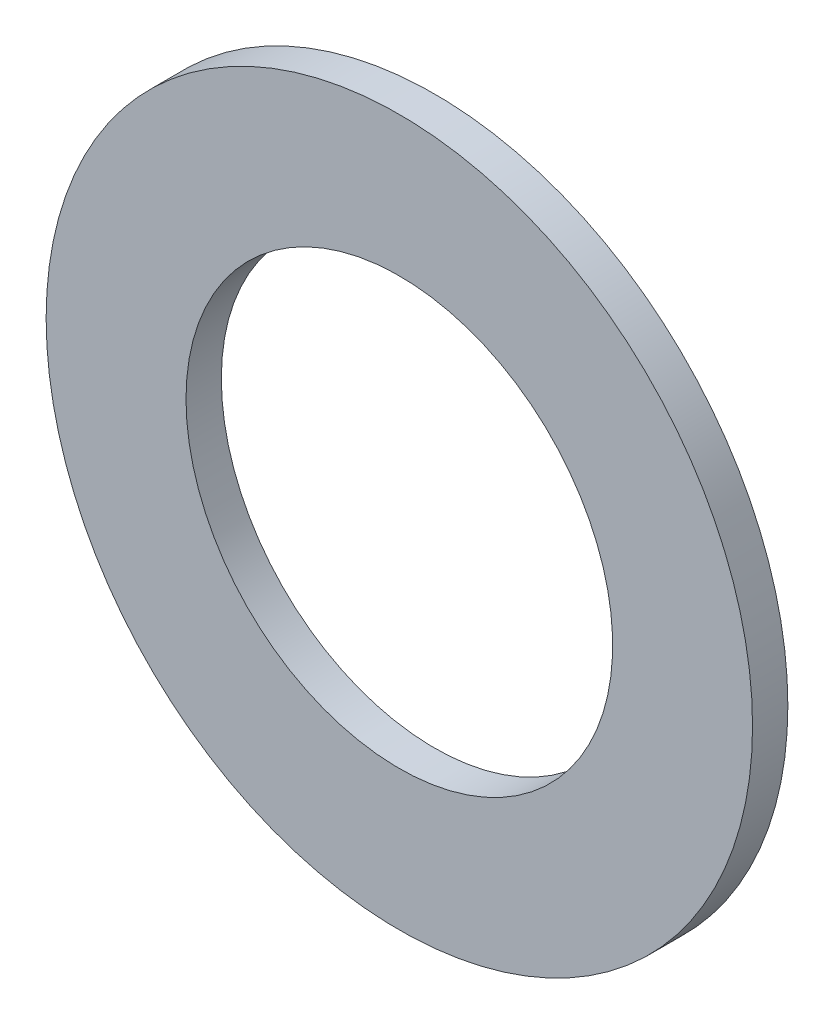
ISO-10303-21;
HEADER;
FILE_DESCRIPTION(('STEP AP214'),'2;1');
FILE_NAME('part.step','',(''),(''),'','','');
FILE_SCHEMA(('AUTOMOTIVE_DESIGN { 1 0 10303 214 1 1 1 1 }'));
ENDSEC;
DATA;
#1=APPLICATION_CONTEXT('core data for automotive mechanical design processes');
#2=APPLICATION_PROTOCOL_DEFINITION('international standard','automotive_design',2000,#1);
#3=PRODUCT_CONTEXT('',#1,'mechanical');
#4=PRODUCT('Part','Part','',(#3));
#5=PRODUCT_RELATED_PRODUCT_CATEGORY('part','',(#4));
#6=PRODUCT_DEFINITION_FORMATION('','',#4);
#7=PRODUCT_DEFINITION_CONTEXT('part definition',#1,'design');
#8=PRODUCT_DEFINITION('design','',#6,#7);
#9=PRODUCT_DEFINITION_SHAPE('','',#8);
#10=(LENGTH_UNIT() NAMED_UNIT(*) SI_UNIT(.MILLI.,.METRE.));
#11=(NAMED_UNIT(*) PLANE_ANGLE_UNIT() SI_UNIT($,.RADIAN.));
#12=(NAMED_UNIT(*) SI_UNIT($,.STERADIAN.) SOLID_ANGLE_UNIT());
#13=UNCERTAINTY_MEASURE_WITH_UNIT(LENGTH_MEASURE(1.E-05),#10,'distance_accuracy_value','');
#14=(GEOMETRIC_REPRESENTATION_CONTEXT(3) GLOBAL_UNCERTAINTY_ASSIGNED_CONTEXT((#13)) GLOBAL_UNIT_ASSIGNED_CONTEXT((#10,
#11,#12)) REPRESENTATION_CONTEXT('',''));
#15=CARTESIAN_POINT('',(0.,0.,0.));
#16=DIRECTION('',(0.,0.,1.));
#17=DIRECTION('',(1.,0.,0.));
#18=AXIS2_PLACEMENT_3D('',#15,#16,#17);
#19=CARTESIAN_POINT('',(0.,0.,-0.79375));
#20=DIRECTION('',(0.,0.,1.));
#21=DIRECTION('',(1.,0.,0.));
#22=AXIS2_PLACEMENT_3D('',#19,#20,#21);
#23=PLANE('',#22);
#24=CARTESIAN_POINT('',(0.,0.,-0.79375));
#25=DIRECTION('',(0.,0.,-1.));
#26=DIRECTION('',(-1.,0.,0.));
#27=AXIS2_PLACEMENT_3D('',#24,#25,#26);
#28=CIRCLE('',#27,9.5885);
#29=CARTESIAN_POINT('',(-9.5885,0.,-0.79375));
#30=VERTEX_POINT('',#29);
#31=EDGE_CURVE('E27',#30,#30,#28,.F.);
#32=ORIENTED_EDGE('',*,*,#31,.T.);
#33=EDGE_LOOP('',(#32));
#34=FACE_BOUND('',#33,.T.);
#35=CARTESIAN_POINT('',(0.,0.,-0.79375));
#36=DIRECTION('',(0.,0.,-1.));
#37=DIRECTION('',(-1.,0.,0.));
#38=AXIS2_PLACEMENT_3D('',#35,#36,#37);
#39=CIRCLE('',#38,15.875);
#40=CARTESIAN_POINT('',(-15.875,0.,-0.79375));
#41=VERTEX_POINT('',#40);
#42=EDGE_CURVE('E18',#41,#41,#39,.F.);
#43=ORIENTED_EDGE('',*,*,#42,.F.);
#44=EDGE_LOOP('',(#43));
#45=FACE_BOUND('',#44,.T.);
#46=ADVANCED_FACE('F15',(#34,#45),#23,.F.);
#47=CARTESIAN_POINT('',(0.,0.,0.79375));
#48=DIRECTION('',(0.,0.,-1.));
#49=DIRECTION('',(-1.,0.,0.));
#50=AXIS2_PLACEMENT_3D('',#47,#48,#49);
#51=CYLINDRICAL_SURFACE('',#50,15.875);
#52=ORIENTED_EDGE('',*,*,#42,.T.);
#53=EDGE_LOOP('',(#52));
#54=FACE_BOUND('',#53,.T.);
#55=CARTESIAN_POINT('',(0.,0.,0.79375));
#56=DIRECTION('',(0.,0.,-1.));
#57=DIRECTION('',(-1.,0.,0.));
#58=AXIS2_PLACEMENT_3D('',#55,#56,#57);
#59=CIRCLE('',#58,15.875);
#60=CARTESIAN_POINT('',(-15.875,0.,0.79375));
#61=VERTEX_POINT('',#60);
#62=EDGE_CURVE('E22',#61,#61,#59,.F.);
#63=ORIENTED_EDGE('',*,*,#62,.F.);
#64=EDGE_LOOP('',(#63));
#65=FACE_BOUND('',#64,.T.);
#66=ADVANCED_FACE('F35',(#54,#65),#51,.T.);
#67=CARTESIAN_POINT('',(0.,0.,0.79375));
#68=DIRECTION('',(0.,0.,-1.));
#69=DIRECTION('',(-1.,0.,0.));
#70=AXIS2_PLACEMENT_3D('',#67,#68,#69);
#71=CYLINDRICAL_SURFACE('',#70,9.5885);
#72=CARTESIAN_POINT('',(0.,0.,0.79375));
#73=DIRECTION('',(0.,0.,-1.));
#74=DIRECTION('',(-1.,0.,0.));
#75=AXIS2_PLACEMENT_3D('',#72,#73,#74);
#76=CIRCLE('',#75,9.5885);
#77=CARTESIAN_POINT('',(-9.5885,0.,0.79375));
#78=VERTEX_POINT('',#77);
#79=EDGE_CURVE('E10',#78,#78,#76,.T.);
#80=ORIENTED_EDGE('',*,*,#79,.F.);
#81=EDGE_LOOP('',(#80));
#82=FACE_BOUND('',#81,.T.);
#83=ORIENTED_EDGE('',*,*,#31,.F.);
#84=EDGE_LOOP('',(#83));
#85=FACE_BOUND('',#84,.T.);
#86=ADVANCED_FACE('F43',(#82,#85),#71,.F.);
#87=CARTESIAN_POINT('',(0.,0.,0.79375));
#88=DIRECTION('',(0.,0.,1.));
#89=DIRECTION('',(1.,0.,0.));
#90=AXIS2_PLACEMENT_3D('',#87,#88,#89);
#91=PLANE('',#90);
#92=ORIENTED_EDGE('',*,*,#79,.T.);
#93=EDGE_LOOP('',(#92));
#94=FACE_BOUND('',#93,.T.);
#95=ORIENTED_EDGE('',*,*,#62,.T.);
#96=EDGE_LOOP('',(#95));
#97=FACE_BOUND('',#96,.T.);
#98=ADVANCED_FACE('F44',(#94,#97),#91,.T.);
#99=CLOSED_SHELL('',(#46,#66,#86,#98));
#100=MANIFOLD_SOLID_BREP('B1',#99);
#101=ADVANCED_BREP_SHAPE_REPRESENTATION('',(#18,#100),#14);
#102=SHAPE_DEFINITION_REPRESENTATION(#9,#101);
ENDSEC;
END-ISO-10303-21;
